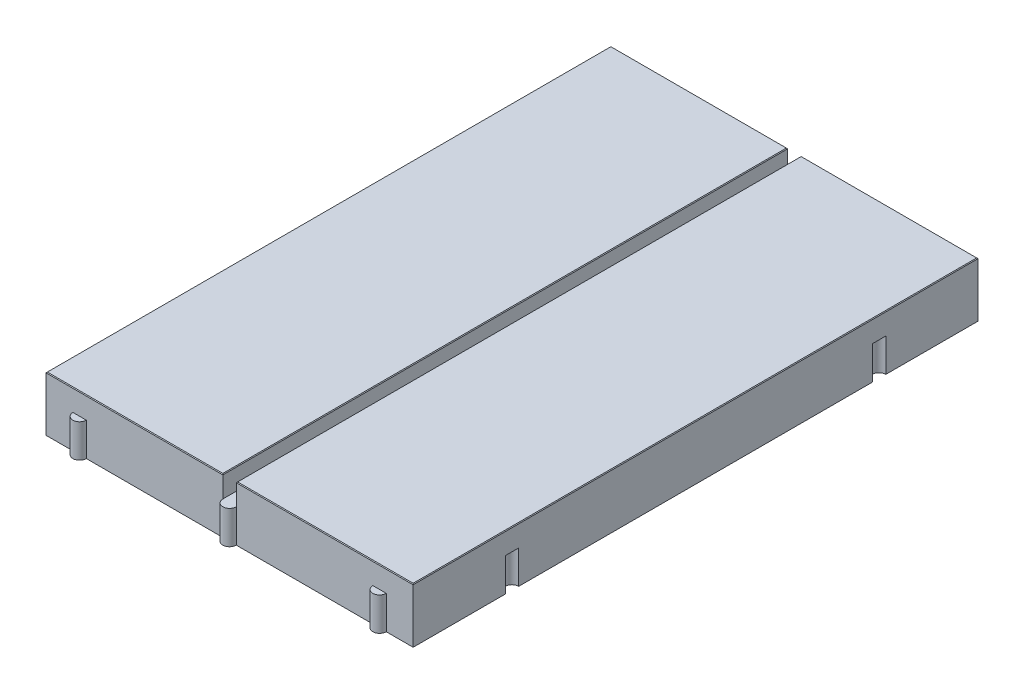
ISO-10303-21;
HEADER;
FILE_DESCRIPTION(('STEP AP214'),'2;1');
FILE_NAME('part.step','',(''),(''),'','','');
FILE_SCHEMA(('AUTOMOTIVE_DESIGN { 1 0 10303 214 1 1 1 1 }'));
ENDSEC;
DATA;
#1=APPLICATION_CONTEXT('core data for automotive mechanical design processes');
#2=APPLICATION_PROTOCOL_DEFINITION('international standard','automotive_design',2000,#1);
#3=PRODUCT_CONTEXT('',#1,'mechanical');
#4=PRODUCT('Part','Part','',(#3));
#5=PRODUCT_RELATED_PRODUCT_CATEGORY('part','',(#4));
#6=PRODUCT_DEFINITION_FORMATION('','',#4);
#7=PRODUCT_DEFINITION_CONTEXT('part definition',#1,'design');
#8=PRODUCT_DEFINITION('design','',#6,#7);
#9=PRODUCT_DEFINITION_SHAPE('','',#8);
#10=(LENGTH_UNIT() NAMED_UNIT(*) SI_UNIT(.MILLI.,.METRE.));
#11=(NAMED_UNIT(*) PLANE_ANGLE_UNIT() SI_UNIT($,.RADIAN.));
#12=(NAMED_UNIT(*) SI_UNIT($,.STERADIAN.) SOLID_ANGLE_UNIT());
#13=UNCERTAINTY_MEASURE_WITH_UNIT(LENGTH_MEASURE(1.E-05),#10,'distance_accuracy_value','');
#14=(GEOMETRIC_REPRESENTATION_CONTEXT(3) GLOBAL_UNCERTAINTY_ASSIGNED_CONTEXT((#13)) GLOBAL_UNIT_ASSIGNED_CONTEXT((#10,
#11,#12)) REPRESENTATION_CONTEXT('',''));
#15=CARTESIAN_POINT('',(0.,0.,0.));
#16=DIRECTION('',(0.,0.,1.));
#17=DIRECTION('',(1.,0.,0.));
#18=AXIS2_PLACEMENT_3D('',#15,#16,#17);
#19=CARTESIAN_POINT('',(27.3,0.,42.));
#20=DIRECTION('',(0.,1.,0.));
#21=DIRECTION('',(0.,0.,1.));
#22=AXIS2_PLACEMENT_3D('',#19,#20,#21);
#23=PLANE('',#22);
#24=CARTESIAN_POINT('',(22.3,0.,-42.));
#25=DIRECTION('',(0.,1.,0.));
#26=DIRECTION('',(0.,0.,1.));
#27=AXIS2_PLACEMENT_3D('',#24,#25,#26);
#28=CIRCLE('',#27,1.);
#29=CARTESIAN_POINT('',(21.3,0.,-42.));
#30=VERTEX_POINT('',#29);
#31=CARTESIAN_POINT('',(23.3,0.,-42.));
#32=VERTEX_POINT('',#31);
#33=EDGE_CURVE('E233',#30,#32,#28,.T.);
#34=ORIENTED_EDGE('',*,*,#33,.T.);
#35=DIRECTION('',(-1.,0.,0.));
#36=VECTOR('',#35,1.);
#37=CARTESIAN_POINT('',(-27.3,0.,-42.));
#38=LINE('',#37,#36);
#39=CARTESIAN_POINT('',(27.3,0.,-42.));
#40=VERTEX_POINT('',#39);
#41=EDGE_CURVE('E245',#40,#32,#38,.T.);
#42=ORIENTED_EDGE('',*,*,#41,.F.);
#43=DIRECTION('',(0.,0.,-1.));
#44=VECTOR('',#43,1.);
#45=CARTESIAN_POINT('',(27.3,0.,-42.));
#46=LINE('',#45,#44);
#47=CARTESIAN_POINT('',(27.3,0.,-28.3));
#48=VERTEX_POINT('',#47);
#49=EDGE_CURVE('E269',#48,#40,#46,.T.);
#50=ORIENTED_EDGE('',*,*,#49,.F.);
#51=CARTESIAN_POINT('',(27.3,0.,-27.3));
#52=DIRECTION('',(0.,1.,0.));
#53=DIRECTION('',(0.,0.,1.));
#54=AXIS2_PLACEMENT_3D('',#51,#52,#53);
#55=CIRCLE('',#54,1.);
#56=CARTESIAN_POINT('',(27.3,0.,-26.3));
#57=VERTEX_POINT('',#56);
#58=EDGE_CURVE('E389',#48,#57,#55,.T.);
#59=ORIENTED_EDGE('',*,*,#58,.T.);
#60=CARTESIAN_POINT('',(27.3,0.,26.3));
#61=VERTEX_POINT('',#60);
#62=EDGE_CURVE('E268',#61,#57,#46,.T.);
#63=ORIENTED_EDGE('',*,*,#62,.F.);
#64=CARTESIAN_POINT('',(27.3,0.,27.3));
#65=DIRECTION('',(0.,1.,0.));
#66=DIRECTION('',(0.,0.,1.));
#67=AXIS2_PLACEMENT_3D('',#64,#65,#66);
#68=CIRCLE('',#67,0.999999999999997);
#69=CARTESIAN_POINT('',(27.3,0.,28.3));
#70=VERTEX_POINT('',#69);
#71=EDGE_CURVE('E402',#61,#70,#68,.T.);
#72=ORIENTED_EDGE('',*,*,#71,.T.);
#73=CARTESIAN_POINT('',(27.3,0.,42.));
#74=VERTEX_POINT('',#73);
#75=EDGE_CURVE('E262',#74,#70,#46,.T.);
#76=ORIENTED_EDGE('',*,*,#75,.F.);
#77=DIRECTION('',(1.,0.,0.));
#78=VECTOR('',#77,1.);
#79=CARTESIAN_POINT('',(-27.3,0.,42.));
#80=LINE('',#79,#78);
#81=CARTESIAN_POINT('',(23.3,0.,42.));
#82=VERTEX_POINT('',#81);
#83=EDGE_CURVE('E445',#82,#74,#80,.T.);
#84=ORIENTED_EDGE('',*,*,#83,.F.);
#85=CARTESIAN_POINT('',(22.3,0.,42.));
#86=DIRECTION('',(0.,1.,0.));
#87=DIRECTION('',(0.,0.,1.));
#88=AXIS2_PLACEMENT_3D('',#85,#86,#87);
#89=CIRCLE('',#88,0.999999999999999);
#90=CARTESIAN_POINT('',(21.3,0.,42.));
#91=VERTEX_POINT('',#90);
#92=EDGE_CURVE('E319',#91,#82,#89,.T.);
#93=ORIENTED_EDGE('',*,*,#92,.F.);
#94=CARTESIAN_POINT('',(1.,0.,42.));
#95=VERTEX_POINT('',#94);
#96=EDGE_CURVE('E446',#95,#91,#80,.T.);
#97=ORIENTED_EDGE('',*,*,#96,.F.);
#98=CARTESIAN_POINT('',(0.,0.,42.));
#99=DIRECTION('',(0.,1.,0.));
#100=DIRECTION('',(0.,0.,1.));
#101=AXIS2_PLACEMENT_3D('',#98,#99,#100);
#102=CIRCLE('',#101,1.);
#103=CARTESIAN_POINT('',(-1.,0.,42.));
#104=VERTEX_POINT('',#103);
#105=EDGE_CURVE('E322',#104,#95,#102,.T.);
#106=ORIENTED_EDGE('',*,*,#105,.F.);
#107=CARTESIAN_POINT('',(-21.3,0.,42.));
#108=VERTEX_POINT('',#107);
#109=EDGE_CURVE('E451',#108,#104,#80,.T.);
#110=ORIENTED_EDGE('',*,*,#109,.F.);
#111=CARTESIAN_POINT('',(-22.3,0.,42.));
#112=DIRECTION('',(0.,1.,0.));
#113=DIRECTION('',(0.,0.,1.));
#114=AXIS2_PLACEMENT_3D('',#111,#112,#113);
#115=CIRCLE('',#114,1.);
#116=CARTESIAN_POINT('',(-23.3,0.,42.));
#117=VERTEX_POINT('',#116);
#118=EDGE_CURVE('E365',#117,#108,#115,.T.);
#119=ORIENTED_EDGE('',*,*,#118,.F.);
#120=CARTESIAN_POINT('',(-27.3,0.,42.));
#121=VERTEX_POINT('',#120);
#122=EDGE_CURVE('E448',#121,#117,#80,.T.);
#123=ORIENTED_EDGE('',*,*,#122,.F.);
#124=DIRECTION('',(0.,0.,1.));
#125=VECTOR('',#124,1.);
#126=CARTESIAN_POINT('',(-27.3,0.,-42.));
#127=LINE('',#126,#125);
#128=CARTESIAN_POINT('',(-27.3,0.,28.3));
#129=VERTEX_POINT('',#128);
#130=EDGE_CURVE('E254',#129,#121,#127,.T.);
#131=ORIENTED_EDGE('',*,*,#130,.F.);
#132=CARTESIAN_POINT('',(-27.3,0.,27.3));
#133=DIRECTION('',(0.,1.,0.));
#134=DIRECTION('',(0.,0.,1.));
#135=AXIS2_PLACEMENT_3D('',#132,#133,#134);
#136=CIRCLE('',#135,1.);
#137=CARTESIAN_POINT('',(-27.3,0.,26.3));
#138=VERTEX_POINT('',#137);
#139=EDGE_CURVE('E340',#138,#129,#136,.T.);
#140=ORIENTED_EDGE('',*,*,#139,.F.);
#141=CARTESIAN_POINT('',(-27.3,0.,-26.3));
#142=VERTEX_POINT('',#141);
#143=EDGE_CURVE('E257',#142,#138,#127,.T.);
#144=ORIENTED_EDGE('',*,*,#143,.F.);
#145=CARTESIAN_POINT('',(-27.3,0.,-27.3));
#146=DIRECTION('',(0.,1.,0.));
#147=DIRECTION('',(0.,0.,1.));
#148=AXIS2_PLACEMENT_3D('',#145,#146,#147);
#149=CIRCLE('',#148,1.);
#150=CARTESIAN_POINT('',(-27.3,0.,-28.3));
#151=VERTEX_POINT('',#150);
#152=EDGE_CURVE('E335',#151,#142,#149,.T.);
#153=ORIENTED_EDGE('',*,*,#152,.F.);
#154=CARTESIAN_POINT('',(-27.3,0.,-42.));
#155=VERTEX_POINT('',#154);
#156=EDGE_CURVE('E259',#155,#151,#127,.T.);
#157=ORIENTED_EDGE('',*,*,#156,.F.);
#158=CARTESIAN_POINT('',(-23.3,0.,-42.));
#159=VERTEX_POINT('',#158);
#160=EDGE_CURVE('E256',#159,#155,#38,.T.);
#161=ORIENTED_EDGE('',*,*,#160,.F.);
#162=CARTESIAN_POINT('',(-22.3,0.,-42.));
#163=DIRECTION('',(0.,1.,0.));
#164=DIRECTION('',(0.,0.,1.));
#165=AXIS2_PLACEMENT_3D('',#162,#163,#164);
#166=CIRCLE('',#165,1.);
#167=CARTESIAN_POINT('',(-21.3,0.,-42.));
#168=VERTEX_POINT('',#167);
#169=EDGE_CURVE('E414',#159,#168,#166,.T.);
#170=ORIENTED_EDGE('',*,*,#169,.T.);
#171=CARTESIAN_POINT('',(-1.,0.,-42.));
#172=VERTEX_POINT('',#171);
#173=EDGE_CURVE('E260',#172,#168,#38,.T.);
#174=ORIENTED_EDGE('',*,*,#173,.F.);
#175=CARTESIAN_POINT('',(0.,0.,-42.));
#176=DIRECTION('',(0.,1.,0.));
#177=DIRECTION('',(0.,0.,1.));
#178=AXIS2_PLACEMENT_3D('',#175,#176,#177);
#179=CIRCLE('',#178,1.);
#180=CARTESIAN_POINT('',(1.,0.,-42.));
#181=VERTEX_POINT('',#180);
#182=EDGE_CURVE('E425',#172,#181,#179,.T.);
#183=ORIENTED_EDGE('',*,*,#182,.T.);
#184=EDGE_CURVE('E247',#30,#181,#38,.T.);
#185=ORIENTED_EDGE('',*,*,#184,.F.);
#186=EDGE_LOOP('',(#34,#42,#50,#59,#63,#72,#76,#84,#93,#97,#106,#110,#119,#123,#131,#140,#144,
#153,#157,#161,#170,#174,#183,#185));
#187=FACE_BOUND('',#186,.T.);
#188=ADVANCED_FACE('F34',(#187),#23,.F.);
#189=CARTESIAN_POINT('',(-27.3,8.15,-42.));
#190=DIRECTION('',(0.,0.,1.));
#191=DIRECTION('',(1.,0.,0.));
#192=AXIS2_PLACEMENT_3D('',#189,#190,#191);
#193=PLANE('',#192);
#194=DIRECTION('',(0.,-1.,0.));
#195=VECTOR('',#194,1.);
#196=CARTESIAN_POINT('',(21.3,7.18606797749979,-42.));
#197=LINE('',#196,#195);
#198=CARTESIAN_POINT('',(21.3,4.95,-42.));
#199=VERTEX_POINT('',#198);
#200=EDGE_CURVE('E51',#199,#30,#197,.T.);
#201=ORIENTED_EDGE('',*,*,#200,.T.);
#202=ORIENTED_EDGE('',*,*,#184,.T.);
#203=DIRECTION('',(0.,-1.,0.));
#204=VECTOR('',#203,1.);
#205=CARTESIAN_POINT('',(1.,7.18606797749979,-42.));
#206=LINE('',#205,#204);
#207=CARTESIAN_POINT('',(1.,4.95,-42.));
#208=VERTEX_POINT('',#207);
#209=EDGE_CURVE('E419',#208,#181,#206,.T.);
#210=ORIENTED_EDGE('',*,*,#209,.F.);
#211=DIRECTION('',(0.,1.,0.));
#212=VECTOR('',#211,1.);
#213=CARTESIAN_POINT('',(1.,4.95,-42.));
#214=LINE('',#213,#212);
#215=CARTESIAN_POINT('',(1.,8.04999999999998,-42.));
#216=VERTEX_POINT('',#215);
#217=EDGE_CURVE('E292',#208,#216,#214,.T.);
#218=ORIENTED_EDGE('',*,*,#217,.T.);
#219=DIRECTION('',(1.,0.,0.));
#220=VECTOR('',#219,1.);
#221=CARTESIAN_POINT('',(27.3,8.04999999999998,-42.));
#222=LINE('',#221,#220);
#223=CARTESIAN_POINT('',(27.3,8.04999999999998,-42.));
#224=VERTEX_POINT('',#223);
#225=EDGE_CURVE('E470',#216,#224,#222,.T.);
#226=ORIENTED_EDGE('',*,*,#225,.T.);
#227=DIRECTION('',(0.,-1.,0.));
#228=VECTOR('',#227,1.);
#229=CARTESIAN_POINT('',(27.3,8.15,-42.));
#230=LINE('',#229,#228);
#231=EDGE_CURVE('E253',#224,#40,#230,.T.);
#232=ORIENTED_EDGE('',*,*,#231,.T.);
#233=ORIENTED_EDGE('',*,*,#41,.T.);
#234=DIRECTION('',(0.,-1.,0.));
#235=VECTOR('',#234,1.);
#236=CARTESIAN_POINT('',(23.3,7.18606797749979,-42.));
#237=LINE('',#236,#235);
#238=CARTESIAN_POINT('',(23.3,4.95,-42.));
#239=VERTEX_POINT('',#238);
#240=EDGE_CURVE('E230',#239,#32,#237,.T.);
#241=ORIENTED_EDGE('',*,*,#240,.F.);
#242=DIRECTION('',(1.,0.,0.));
#243=VECTOR('',#242,1.);
#244=CARTESIAN_POINT('',(21.3,4.95,-42.));
#245=LINE('',#244,#243);
#246=EDGE_CURVE('E239',#199,#239,#245,.T.);
#247=ORIENTED_EDGE('',*,*,#246,.F.);
#248=EDGE_LOOP('',(#201,#202,#210,#218,#226,#232,#233,#241,#247));
#249=FACE_BOUND('',#248,.T.);
#250=ADVANCED_FACE('F250',(#249),#193,.F.);
#251=DIRECTION('',(0.,-1.,0.));
#252=VECTOR('',#251,1.);
#253=CARTESIAN_POINT('',(-1.,7.18606797749979,-42.));
#254=LINE('',#253,#252);
#255=CARTESIAN_POINT('',(-1.,4.95,-42.));
#256=VERTEX_POINT('',#255);
#257=EDGE_CURVE('E422',#256,#172,#254,.T.);
#258=ORIENTED_EDGE('',*,*,#257,.T.);
#259=ORIENTED_EDGE('',*,*,#173,.T.);
#260=DIRECTION('',(0.,-1.,0.));
#261=VECTOR('',#260,1.);
#262=CARTESIAN_POINT('',(-21.3,7.18606797749979,-42.));
#263=LINE('',#262,#261);
#264=CARTESIAN_POINT('',(-21.3,4.95,-42.));
#265=VERTEX_POINT('',#264);
#266=EDGE_CURVE('E410',#265,#168,#263,.T.);
#267=ORIENTED_EDGE('',*,*,#266,.F.);
#268=DIRECTION('',(1.,0.,0.));
#269=VECTOR('',#268,1.);
#270=CARTESIAN_POINT('',(-23.3,4.95,-42.));
#271=LINE('',#270,#269);
#272=CARTESIAN_POINT('',(-23.3,4.95,-42.));
#273=VERTEX_POINT('',#272);
#274=EDGE_CURVE('E407',#273,#265,#271,.T.);
#275=ORIENTED_EDGE('',*,*,#274,.F.);
#276=DIRECTION('',(0.,-1.,0.));
#277=VECTOR('',#276,1.);
#278=CARTESIAN_POINT('',(-23.3,7.18606797749979,-42.));
#279=LINE('',#278,#277);
#280=EDGE_CURVE('E59',#273,#159,#279,.T.);
#281=ORIENTED_EDGE('',*,*,#280,.T.);
#282=ORIENTED_EDGE('',*,*,#160,.T.);
#283=DIRECTION('',(0.,-1.,0.));
#284=VECTOR('',#283,1.);
#285=CARTESIAN_POINT('',(-27.3,8.15,-42.));
#286=LINE('',#285,#284);
#287=CARTESIAN_POINT('',(-27.3,8.04999999999998,-42.));
#288=VERTEX_POINT('',#287);
#289=EDGE_CURVE('E456',#288,#155,#286,.T.);
#290=ORIENTED_EDGE('',*,*,#289,.F.);
#291=DIRECTION('',(1.,0.,0.));
#292=VECTOR('',#291,1.);
#293=CARTESIAN_POINT('',(-1.,8.04999999999998,-42.));
#294=LINE('',#293,#292);
#295=CARTESIAN_POINT('',(-1.,8.04999999999998,-42.));
#296=VERTEX_POINT('',#295);
#297=EDGE_CURVE('E468',#288,#296,#294,.T.);
#298=ORIENTED_EDGE('',*,*,#297,.T.);
#299=DIRECTION('',(0.,1.,0.));
#300=VECTOR('',#299,1.);
#301=CARTESIAN_POINT('',(-1.,4.95,-42.));
#302=LINE('',#301,#300);
#303=EDGE_CURVE('E285',#256,#296,#302,.T.);
#304=ORIENTED_EDGE('',*,*,#303,.F.);
#305=EDGE_LOOP('',(#258,#259,#267,#275,#281,#282,#290,#298,#304));
#306=FACE_BOUND('',#305,.T.);
#307=ADVANCED_FACE('F436',(#306),#193,.F.);
#308=CARTESIAN_POINT('',(1.,4.95,-42.));
#309=DIRECTION('',(0.,-1.,0.));
#310=DIRECTION('',(0.,0.,-1.));
#311=AXIS2_PLACEMENT_3D('',#308,#309,#310);
#312=PLANE('',#311);
#313=CARTESIAN_POINT('',(0.,4.95,-42.));
#314=DIRECTION('',(0.,-1.,0.));
#315=DIRECTION('',(0.,0.,-1.));
#316=AXIS2_PLACEMENT_3D('',#313,#314,#315);
#317=CIRCLE('',#316,1.);
#318=EDGE_CURVE('E417',#208,#256,#317,.T.);
#319=ORIENTED_EDGE('',*,*,#318,.T.);
#320=DIRECTION('',(0.,0.,1.));
#321=VECTOR('',#320,1.);
#322=CARTESIAN_POINT('',(-1.,4.95,42.));
#323=LINE('',#322,#321);
#324=CARTESIAN_POINT('',(-1.,4.95,42.));
#325=VERTEX_POINT('',#324);
#326=EDGE_CURVE('E288',#256,#325,#323,.T.);
#327=ORIENTED_EDGE('',*,*,#326,.T.);
#328=CARTESIAN_POINT('',(0.,4.95,42.));
#329=DIRECTION('',(0.,-1.,0.));
#330=DIRECTION('',(0.,0.,-1.));
#331=AXIS2_PLACEMENT_3D('',#328,#329,#330);
#332=CIRCLE('',#331,1.);
#333=CARTESIAN_POINT('',(1.,4.95,42.));
#334=VERTEX_POINT('',#333);
#335=EDGE_CURVE('E333',#334,#325,#332,.T.);
#336=ORIENTED_EDGE('',*,*,#335,.F.);
#337=DIRECTION('',(0.,0.,-1.));
#338=VECTOR('',#337,1.);
#339=CARTESIAN_POINT('',(1.,4.95,42.));
#340=LINE('',#339,#338);
#341=EDGE_CURVE('E298',#334,#208,#340,.T.);
#342=ORIENTED_EDGE('',*,*,#341,.T.);
#343=EDGE_LOOP('',(#319,#327,#336,#342));
#344=FACE_BOUND('',#343,.T.);
#345=ADVANCED_FACE('F555',(#344),#312,.F.);
#346=CARTESIAN_POINT('',(27.3,8.15,-42.));
#347=DIRECTION('',(-1.,0.,0.));
#348=DIRECTION('',(0.,0.,1.));
#349=AXIS2_PLACEMENT_3D('',#346,#347,#348);
#350=PLANE('',#349);
#351=DIRECTION('',(0.,-1.,0.));
#352=VECTOR('',#351,1.);
#353=CARTESIAN_POINT('',(27.3,7.18606797749979,26.3));
#354=LINE('',#353,#352);
#355=CARTESIAN_POINT('',(27.3,4.95,26.3));
#356=VERTEX_POINT('',#355);
#357=EDGE_CURVE('E399',#356,#61,#354,.T.);
#358=ORIENTED_EDGE('',*,*,#357,.T.);
#359=ORIENTED_EDGE('',*,*,#62,.T.);
#360=DIRECTION('',(0.,-1.,0.));
#361=VECTOR('',#360,1.);
#362=CARTESIAN_POINT('',(27.3,7.18606797749979,-26.3));
#363=LINE('',#362,#361);
#364=CARTESIAN_POINT('',(27.3,4.95,-26.3));
#365=VERTEX_POINT('',#364);
#366=EDGE_CURVE('E384',#365,#57,#363,.T.);
#367=ORIENTED_EDGE('',*,*,#366,.F.);
#368=DIRECTION('',(0.,0.,1.));
#369=VECTOR('',#368,1.);
#370=CARTESIAN_POINT('',(27.3,4.95,-28.3));
#371=LINE('',#370,#369);
#372=CARTESIAN_POINT('',(27.3,4.95,-28.3));
#373=VERTEX_POINT('',#372);
#374=EDGE_CURVE('E381',#373,#365,#371,.T.);
#375=ORIENTED_EDGE('',*,*,#374,.F.);
#376=DIRECTION('',(0.,-1.,0.));
#377=VECTOR('',#376,1.);
#378=CARTESIAN_POINT('',(27.3,7.18606797749979,-28.3));
#379=LINE('',#378,#377);
#380=EDGE_CURVE('E387',#373,#48,#379,.T.);
#381=ORIENTED_EDGE('',*,*,#380,.T.);
#382=ORIENTED_EDGE('',*,*,#49,.T.);
#383=ORIENTED_EDGE('',*,*,#231,.F.);
#384=DIRECTION('',(0.,0.,1.));
#385=VECTOR('',#384,1.);
#386=CARTESIAN_POINT('',(27.3,8.04999999999998,42.));
#387=LINE('',#386,#385);
#388=CARTESIAN_POINT('',(27.3,8.04999999999998,42.));
#389=VERTEX_POINT('',#388);
#390=EDGE_CURVE('E472',#224,#389,#387,.T.);
#391=ORIENTED_EDGE('',*,*,#390,.T.);
#392=DIRECTION('',(0.,-1.,0.));
#393=VECTOR('',#392,1.);
#394=CARTESIAN_POINT('',(27.3,8.15,42.));
#395=LINE('',#394,#393);
#396=EDGE_CURVE('E450',#389,#74,#395,.T.);
#397=ORIENTED_EDGE('',*,*,#396,.T.);
#398=ORIENTED_EDGE('',*,*,#75,.T.);
#399=DIRECTION('',(0.,-1.,0.));
#400=VECTOR('',#399,1.);
#401=CARTESIAN_POINT('',(27.3,7.18606797749979,28.3));
#402=LINE('',#401,#400);
#403=CARTESIAN_POINT('',(27.3,4.95,28.3));
#404=VERTEX_POINT('',#403);
#405=EDGE_CURVE('E397',#404,#70,#402,.T.);
#406=ORIENTED_EDGE('',*,*,#405,.F.);
#407=DIRECTION('',(0.,0.,1.));
#408=VECTOR('',#407,1.);
#409=CARTESIAN_POINT('',(27.3,4.95,26.3));
#410=LINE('',#409,#408);
#411=EDGE_CURVE('E394',#356,#404,#410,.T.);
#412=ORIENTED_EDGE('',*,*,#411,.F.);
#413=EDGE_LOOP('',(#358,#359,#367,#375,#381,#382,#383,#391,#397,#398,#406,#412));
#414=FACE_BOUND('',#413,.T.);
#415=ADVANCED_FACE('F556',(#414),#350,.F.);
#416=CARTESIAN_POINT('',(-27.3,8.15,42.));
#417=DIRECTION('',(0.,0.,-1.));
#418=DIRECTION('',(-1.,0.,0.));
#419=AXIS2_PLACEMENT_3D('',#416,#417,#418);
#420=PLANE('',#419);
#421=DIRECTION('',(0.,-1.,0.));
#422=VECTOR('',#421,1.);
#423=CARTESIAN_POINT('',(-21.3,7.1860679774998,42.));
#424=LINE('',#423,#422);
#425=CARTESIAN_POINT('',(-21.3,4.95,42.));
#426=VERTEX_POINT('',#425);
#427=EDGE_CURVE('E369',#426,#108,#424,.T.);
#428=ORIENTED_EDGE('',*,*,#427,.T.);
#429=ORIENTED_EDGE('',*,*,#109,.T.);
#430=DIRECTION('',(0.,-1.,0.));
#431=VECTOR('',#430,1.);
#432=CARTESIAN_POINT('',(-1.,7.1860679774998,42.));
#433=LINE('',#432,#431);
#434=EDGE_CURVE('E330',#325,#104,#433,.T.);
#435=ORIENTED_EDGE('',*,*,#434,.F.);
#436=DIRECTION('',(0.,1.,0.));
#437=VECTOR('',#436,1.);
#438=CARTESIAN_POINT('',(-1.,4.95,42.));
#439=LINE('',#438,#437);
#440=CARTESIAN_POINT('',(-1.,8.04999999999998,42.));
#441=VERTEX_POINT('',#440);
#442=EDGE_CURVE('E278',#325,#441,#439,.T.);
#443=ORIENTED_EDGE('',*,*,#442,.T.);
#444=DIRECTION('',(-1.,0.,0.));
#445=VECTOR('',#444,1.);
#446=CARTESIAN_POINT('',(-27.3,8.04999999999998,42.));
#447=LINE('',#446,#445);
#448=CARTESIAN_POINT('',(-27.3,8.04999999999998,42.));
#449=VERTEX_POINT('',#448);
#450=EDGE_CURVE('E474',#441,#449,#447,.T.);
#451=ORIENTED_EDGE('',*,*,#450,.T.);
#452=DIRECTION('',(0.,-1.,0.));
#453=VECTOR('',#452,1.);
#454=CARTESIAN_POINT('',(-27.3,8.15,42.));
#455=LINE('',#454,#453);
#456=EDGE_CURVE('E453',#449,#121,#455,.T.);
#457=ORIENTED_EDGE('',*,*,#456,.T.);
#458=ORIENTED_EDGE('',*,*,#122,.T.);
#459=DIRECTION('',(0.,-1.,0.));
#460=VECTOR('',#459,1.);
#461=CARTESIAN_POINT('',(-23.3,7.1860679774998,42.));
#462=LINE('',#461,#460);
#463=CARTESIAN_POINT('',(-23.3,4.95,42.));
#464=VERTEX_POINT('',#463);
#465=EDGE_CURVE('E373',#464,#117,#462,.T.);
#466=ORIENTED_EDGE('',*,*,#465,.F.);
#467=DIRECTION('',(-1.,0.,0.));
#468=VECTOR('',#467,1.);
#469=CARTESIAN_POINT('',(-23.3,4.95,42.));
#470=LINE('',#469,#468);
#471=EDGE_CURVE('E370',#426,#464,#470,.T.);
#472=ORIENTED_EDGE('',*,*,#471,.F.);
#473=EDGE_LOOP('',(#428,#429,#435,#443,#451,#457,#458,#466,#472));
#474=FACE_BOUND('',#473,.T.);
#475=ADVANCED_FACE('F521',(#474),#420,.F.);
#476=CARTESIAN_POINT('',(-27.3,8.15,-42.));
#477=DIRECTION('',(1.,0.,0.));
#478=DIRECTION('',(0.,0.,-1.));
#479=AXIS2_PLACEMENT_3D('',#476,#477,#478);
#480=PLANE('',#479);
#481=DIRECTION('',(0.,-1.,0.));
#482=VECTOR('',#481,1.);
#483=CARTESIAN_POINT('',(-27.3,7.1860679774998,28.3));
#484=LINE('',#483,#482);
#485=CARTESIAN_POINT('',(-27.3,4.95,28.3));
#486=VERTEX_POINT('',#485);
#487=EDGE_CURVE('E354',#486,#129,#484,.T.);
#488=ORIENTED_EDGE('',*,*,#487,.T.);
#489=ORIENTED_EDGE('',*,*,#130,.T.);
#490=ORIENTED_EDGE('',*,*,#456,.F.);
#491=DIRECTION('',(0.,0.,-1.));
#492=VECTOR('',#491,1.);
#493=CARTESIAN_POINT('',(-27.3,8.04999999999998,-42.));
#494=LINE('',#493,#492);
#495=EDGE_CURVE('E43',#449,#288,#494,.T.);
#496=ORIENTED_EDGE('',*,*,#495,.T.);
#497=ORIENTED_EDGE('',*,*,#289,.T.);
#498=ORIENTED_EDGE('',*,*,#156,.T.);
#499=DIRECTION('',(0.,-1.,0.));
#500=VECTOR('',#499,1.);
#501=CARTESIAN_POINT('',(-27.3,7.1860679774998,-28.3));
#502=LINE('',#501,#500);
#503=CARTESIAN_POINT('',(-27.3,4.95,-28.3));
#504=VERTEX_POINT('',#503);
#505=EDGE_CURVE('E344',#504,#151,#502,.T.);
#506=ORIENTED_EDGE('',*,*,#505,.F.);
#507=DIRECTION('',(0.,0.,-1.));
#508=VECTOR('',#507,1.);
#509=CARTESIAN_POINT('',(-27.3,4.95,-28.3));
#510=LINE('',#509,#508);
#511=CARTESIAN_POINT('',(-27.3,4.95,-26.3));
#512=VERTEX_POINT('',#511);
#513=EDGE_CURVE('E336',#512,#504,#510,.T.);
#514=ORIENTED_EDGE('',*,*,#513,.F.);
#515=DIRECTION('',(0.,-1.,0.));
#516=VECTOR('',#515,1.);
#517=CARTESIAN_POINT('',(-27.3,7.1860679774998,-26.3));
#518=LINE('',#517,#516);
#519=EDGE_CURVE('E343',#512,#142,#518,.T.);
#520=ORIENTED_EDGE('',*,*,#519,.T.);
#521=ORIENTED_EDGE('',*,*,#143,.T.);
#522=DIRECTION('',(0.,-1.,0.));
#523=VECTOR('',#522,1.);
#524=CARTESIAN_POINT('',(-27.3,7.1860679774998,26.3));
#525=LINE('',#524,#523);
#526=CARTESIAN_POINT('',(-27.3,4.95,26.3));
#527=VERTEX_POINT('',#526);
#528=EDGE_CURVE('E358',#527,#138,#525,.T.);
#529=ORIENTED_EDGE('',*,*,#528,.F.);
#530=DIRECTION('',(0.,0.,-1.));
#531=VECTOR('',#530,1.);
#532=CARTESIAN_POINT('',(-27.3,4.95,26.3));
#533=LINE('',#532,#531);
#534=EDGE_CURVE('E355',#486,#527,#533,.T.);
#535=ORIENTED_EDGE('',*,*,#534,.F.);
#536=EDGE_LOOP('',(#488,#489,#490,#496,#497,#498,#506,#514,#520,#521,#529,#535));
#537=FACE_BOUND('',#536,.T.);
#538=ADVANCED_FACE('F550',(#537),#480,.F.);
#539=DIRECTION('',(0.,-1.,0.));
#540=VECTOR('',#539,1.);
#541=CARTESIAN_POINT('',(1.,7.1860679774998,42.));
#542=LINE('',#541,#540);
#543=EDGE_CURVE('E327',#334,#95,#542,.T.);
#544=ORIENTED_EDGE('',*,*,#543,.T.);
#545=ORIENTED_EDGE('',*,*,#96,.T.);
#546=DIRECTION('',(0.,-1.,0.));
#547=VECTOR('',#546,1.);
#548=CARTESIAN_POINT('',(21.3,7.1860679774998,42.));
#549=LINE('',#548,#547);
#550=CARTESIAN_POINT('',(21.3,4.95,42.));
#551=VERTEX_POINT('',#550);
#552=EDGE_CURVE('E313',#551,#91,#549,.T.);
#553=ORIENTED_EDGE('',*,*,#552,.F.);
#554=DIRECTION('',(-1.,0.,0.));
#555=VECTOR('',#554,1.);
#556=CARTESIAN_POINT('',(0.,4.95,42.));
#557=LINE('',#556,#555);
#558=CARTESIAN_POINT('',(23.3,4.95,42.));
#559=VERTEX_POINT('',#558);
#560=EDGE_CURVE('E312',#559,#551,#557,.T.);
#561=ORIENTED_EDGE('',*,*,#560,.F.);
#562=DIRECTION('',(0.,-1.,0.));
#563=VECTOR('',#562,1.);
#564=CARTESIAN_POINT('',(23.3,7.1860679774998,42.));
#565=LINE('',#564,#563);
#566=EDGE_CURVE('E316',#559,#82,#565,.T.);
#567=ORIENTED_EDGE('',*,*,#566,.T.);
#568=ORIENTED_EDGE('',*,*,#83,.T.);
#569=ORIENTED_EDGE('',*,*,#396,.F.);
#570=DIRECTION('',(-1.,0.,0.));
#571=VECTOR('',#570,1.);
#572=CARTESIAN_POINT('',(1.,8.04999999999998,42.));
#573=LINE('',#572,#571);
#574=CARTESIAN_POINT('',(1.,8.04999999999998,42.));
#575=VERTEX_POINT('',#574);
#576=EDGE_CURVE('E477',#389,#575,#573,.T.);
#577=ORIENTED_EDGE('',*,*,#576,.T.);
#578=DIRECTION('',(0.,1.,0.));
#579=VECTOR('',#578,1.);
#580=CARTESIAN_POINT('',(1.,4.95,42.));
#581=LINE('',#580,#579);
#582=EDGE_CURVE('E275',#334,#575,#581,.T.);
#583=ORIENTED_EDGE('',*,*,#582,.F.);
#584=EDGE_LOOP('',(#544,#545,#553,#561,#567,#568,#569,#577,#583));
#585=FACE_BOUND('',#584,.T.);
#586=ADVANCED_FACE('F539',(#585),#420,.F.);
#587=CARTESIAN_POINT('',(27.3,8.15,42.));
#588=DIRECTION('',(0.,1.,0.));
#589=DIRECTION('',(0.,0.,1.));
#590=AXIS2_PLACEMENT_3D('',#587,#588,#589);
#591=PLANE('',#590);
#592=DIRECTION('',(0.,0.,-1.));
#593=VECTOR('',#592,1.);
#594=CARTESIAN_POINT('',(27.2,8.15,-42.));
#595=LINE('',#594,#593);
#596=CARTESIAN_POINT('',(27.2,8.15,41.9));
#597=VERTEX_POINT('',#596);
#598=CARTESIAN_POINT('',(27.2,8.15,-41.9));
#599=VERTEX_POINT('',#598);
#600=EDGE_CURVE('E463',#597,#599,#595,.T.);
#601=ORIENTED_EDGE('',*,*,#600,.T.);
#602=DIRECTION('',(-1.,0.,0.));
#603=VECTOR('',#602,1.);
#604=CARTESIAN_POINT('',(1.,8.15,-41.9));
#605=LINE('',#604,#603);
#606=CARTESIAN_POINT('',(1.1,8.15,-41.9));
#607=VERTEX_POINT('',#606);
#608=EDGE_CURVE('E465',#599,#607,#605,.T.);
#609=ORIENTED_EDGE('',*,*,#608,.T.);
#610=DIRECTION('',(0.,0.,1.));
#611=VECTOR('',#610,1.);
#612=CARTESIAN_POINT('',(1.1,8.15,42.));
#613=LINE('',#612,#611);
#614=CARTESIAN_POINT('',(1.1,8.15,41.9));
#615=VERTEX_POINT('',#614);
#616=EDGE_CURVE('E459',#607,#615,#613,.T.);
#617=ORIENTED_EDGE('',*,*,#616,.T.);
#618=DIRECTION('',(1.,0.,0.));
#619=VECTOR('',#618,1.);
#620=CARTESIAN_POINT('',(27.3,8.15,41.9));
#621=LINE('',#620,#619);
#622=EDGE_CURVE('E461',#615,#597,#621,.T.);
#623=ORIENTED_EDGE('',*,*,#622,.T.);
#624=EDGE_LOOP('',(#601,#609,#617,#623));
#625=FACE_BOUND('',#624,.T.);
#626=ADVANCED_FACE('F532',(#625),#591,.T.);
#627=DIRECTION('',(0.,0.,1.));
#628=VECTOR('',#627,1.);
#629=CARTESIAN_POINT('',(-27.2,8.15,42.));
#630=LINE('',#629,#628);
#631=CARTESIAN_POINT('',(-27.2,8.15,-41.9));
#632=VERTEX_POINT('',#631);
#633=CARTESIAN_POINT('',(-27.2,8.15,41.9));
#634=VERTEX_POINT('',#633);
#635=EDGE_CURVE('E485',#632,#634,#630,.T.);
#636=ORIENTED_EDGE('',*,*,#635,.T.);
#637=DIRECTION('',(1.,0.,0.));
#638=VECTOR('',#637,1.);
#639=CARTESIAN_POINT('',(-1.,8.15,41.9));
#640=LINE('',#639,#638);
#641=CARTESIAN_POINT('',(-1.1,8.15,41.9));
#642=VERTEX_POINT('',#641);
#643=EDGE_CURVE('E487',#634,#642,#640,.T.);
#644=ORIENTED_EDGE('',*,*,#643,.T.);
#645=DIRECTION('',(0.,0.,-1.));
#646=VECTOR('',#645,1.);
#647=CARTESIAN_POINT('',(-1.1,8.15,-42.));
#648=LINE('',#647,#646);
#649=CARTESIAN_POINT('',(-1.1,8.15,-41.9));
#650=VERTEX_POINT('',#649);
#651=EDGE_CURVE('E481',#642,#650,#648,.T.);
#652=ORIENTED_EDGE('',*,*,#651,.T.);
#653=DIRECTION('',(-1.,0.,0.));
#654=VECTOR('',#653,1.);
#655=CARTESIAN_POINT('',(-27.3,8.15,-41.9));
#656=LINE('',#655,#654);
#657=EDGE_CURVE('E483',#650,#632,#656,.T.);
#658=ORIENTED_EDGE('',*,*,#657,.T.);
#659=EDGE_LOOP('',(#636,#644,#652,#658));
#660=FACE_BOUND('',#659,.T.);
#661=ADVANCED_FACE('F529',(#660),#591,.T.);
#662=CARTESIAN_POINT('',(1.,4.95,42.));
#663=DIRECTION('',(1.,0.,0.));
#664=DIRECTION('',(0.,0.,-1.));
#665=AXIS2_PLACEMENT_3D('',#662,#663,#664);
#666=PLANE('',#665);
#667=ORIENTED_EDGE('',*,*,#582,.T.);
#668=DIRECTION('',(0.,0.,-1.));
#669=VECTOR('',#668,1.);
#670=CARTESIAN_POINT('',(1.,8.04999999999998,-42.));
#671=LINE('',#670,#669);
#672=EDGE_CURVE('E479',#575,#216,#671,.T.);
#673=ORIENTED_EDGE('',*,*,#672,.T.);
#674=ORIENTED_EDGE('',*,*,#217,.F.);
#675=ORIENTED_EDGE('',*,*,#341,.F.);
#676=EDGE_LOOP('',(#667,#673,#674,#675));
#677=FACE_BOUND('',#676,.T.);
#678=ADVANCED_FACE('F531',(#677),#666,.F.);
#679=CARTESIAN_POINT('',(-1.,4.95,42.));
#680=DIRECTION('',(-1.,0.,0.));
#681=DIRECTION('',(0.,0.,1.));
#682=AXIS2_PLACEMENT_3D('',#679,#680,#681);
#683=PLANE('',#682);
#684=ORIENTED_EDGE('',*,*,#303,.T.);
#685=DIRECTION('',(0.,0.,1.));
#686=VECTOR('',#685,1.);
#687=CARTESIAN_POINT('',(-1.,8.04999999999998,42.));
#688=LINE('',#687,#686);
#689=EDGE_CURVE('E11',#296,#441,#688,.T.);
#690=ORIENTED_EDGE('',*,*,#689,.T.);
#691=ORIENTED_EDGE('',*,*,#442,.F.);
#692=ORIENTED_EDGE('',*,*,#326,.F.);
#693=EDGE_LOOP('',(#684,#690,#691,#692));
#694=FACE_BOUND('',#693,.T.);
#695=ADVANCED_FACE('F516',(#694),#683,.F.);
#696=CARTESIAN_POINT('',(27.3,8.15,41.9));
#697=DIRECTION('',(0.,0.707106781186499,0.707106781186597));
#698=DIRECTION('',(0.,-0.707106781186597,0.707106781186499));
#699=AXIS2_PLACEMENT_3D('',#696,#697,#698);
#700=PLANE('',#699);
#701=DIRECTION('',(0.577350269189601,0.577350269189678,-0.577350269189598));
#702=VECTOR('',#701,1.);
#703=CARTESIAN_POINT('',(1.,8.04999999999998,42.));
#704=LINE('',#703,#702);
#705=EDGE_CURVE('E306',#575,#615,#704,.T.);
#706=ORIENTED_EDGE('',*,*,#705,.F.);
#707=ORIENTED_EDGE('',*,*,#576,.F.);
#708=DIRECTION('',(-0.577350269189599,0.577350269189679,-0.577350269189599));
#709=VECTOR('',#708,1.);
#710=CARTESIAN_POINT('',(27.2333333333333,8.11666666666666,41.9333333333333));
#711=LINE('',#710,#709);
#712=EDGE_CURVE('E304',#597,#389,#711,.F.);
#713=ORIENTED_EDGE('',*,*,#712,.F.);
#714=ORIENTED_EDGE('',*,*,#622,.F.);
#715=EDGE_LOOP('',(#706,#707,#713,#714));
#716=FACE_BOUND('',#715,.T.);
#717=ADVANCED_FACE('F570',(#716),#700,.T.);
#718=CARTESIAN_POINT('',(27.2,8.15,42.));
#719=DIRECTION('',(0.707106781186597,0.707106781186499,0.));
#720=DIRECTION('',(-0.707106781186499,0.707106781186597,0.));
#721=AXIS2_PLACEMENT_3D('',#718,#719,#720);
#722=PLANE('',#721);
#723=ORIENTED_EDGE('',*,*,#712,.T.);
#724=ORIENTED_EDGE('',*,*,#390,.F.);
#725=DIRECTION('',(-0.577350269189599,0.577350269189679,0.577350269189599));
#726=VECTOR('',#725,1.);
#727=CARTESIAN_POINT('',(-0.766666666664088,36.116666666668,-13.9333333333359));
#728=LINE('',#727,#726);
#729=EDGE_CURVE('E493',#599,#224,#728,.F.);
#730=ORIENTED_EDGE('',*,*,#729,.F.);
#731=ORIENTED_EDGE('',*,*,#600,.F.);
#732=EDGE_LOOP('',(#723,#724,#730,#731));
#733=FACE_BOUND('',#732,.T.);
#734=ADVANCED_FACE('F566',(#733),#722,.T.);
#735=CARTESIAN_POINT('',(1.,8.04999999999998,42.));
#736=DIRECTION('',(-0.707106781186595,0.7071067811865,0.));
#737=DIRECTION('',(-0.7071067811865,-0.707106781186595,0.));
#738=AXIS2_PLACEMENT_3D('',#735,#736,#737);
#739=PLANE('',#738);
#740=ORIENTED_EDGE('',*,*,#705,.T.);
#741=ORIENTED_EDGE('',*,*,#616,.F.);
#742=DIRECTION('',(-0.577350269189601,-0.577350269189678,-0.577350269189598));
#743=VECTOR('',#742,1.);
#744=CARTESIAN_POINT('',(28.9999999999974,36.0500000000012,-14.0000000000027));
#745=LINE('',#744,#743);
#746=EDGE_CURVE('E491',#216,#607,#745,.F.);
#747=ORIENTED_EDGE('',*,*,#746,.F.);
#748=ORIENTED_EDGE('',*,*,#672,.F.);
#749=EDGE_LOOP('',(#740,#741,#747,#748));
#750=FACE_BOUND('',#749,.T.);
#751=ADVANCED_FACE('F562',(#750),#739,.T.);
#752=CARTESIAN_POINT('',(27.3,8.15,-41.9));
#753=DIRECTION('',(0.,0.707106781186499,-0.707106781186597));
#754=DIRECTION('',(0.,0.707106781186597,0.707106781186499));
#755=AXIS2_PLACEMENT_3D('',#752,#753,#754);
#756=PLANE('',#755);
#757=ORIENTED_EDGE('',*,*,#729,.T.);
#758=ORIENTED_EDGE('',*,*,#225,.F.);
#759=ORIENTED_EDGE('',*,*,#746,.T.);
#760=ORIENTED_EDGE('',*,*,#608,.F.);
#761=EDGE_LOOP('',(#757,#758,#759,#760));
#762=FACE_BOUND('',#761,.T.);
#763=ADVANCED_FACE('F559',(#762),#756,.T.);
#764=CARTESIAN_POINT('',(27.3,8.15,-41.9));
#765=DIRECTION('',(0.,0.707106781186499,-0.707106781186597));
#766=DIRECTION('',(0.,0.707106781186597,0.707106781186499));
#767=AXIS2_PLACEMENT_3D('',#764,#765,#766);
#768=PLANE('',#767);
#769=DIRECTION('',(-0.577350269189604,0.577350269189677,0.577350269189597));
#770=VECTOR('',#769,1.);
#771=CARTESIAN_POINT('',(-28.9999999999975,36.050000000001,-14.0000000000028));
#772=LINE('',#771,#770);
#773=EDGE_CURVE('E499',#296,#650,#772,.T.);
#774=ORIENTED_EDGE('',*,*,#773,.F.);
#775=ORIENTED_EDGE('',*,*,#297,.F.);
#776=DIRECTION('',(0.577350269189626,0.577350269189666,0.577350269189586));
#777=VECTOR('',#776,1.);
#778=CARTESIAN_POINT('',(-9.03333333333333,26.3166666666679,-23.7333333333346));
#779=LINE('',#778,#777);
#780=EDGE_CURVE('E38',#632,#288,#779,.F.);
#781=ORIENTED_EDGE('',*,*,#780,.F.);
#782=ORIENTED_EDGE('',*,*,#657,.F.);
#783=EDGE_LOOP('',(#774,#775,#781,#782));
#784=FACE_BOUND('',#783,.T.);
#785=ADVANCED_FACE('F36',(#784),#768,.T.);
#786=CARTESIAN_POINT('',(-27.2,8.15,42.));
#787=DIRECTION('',(-0.707106781186572,0.707106781186523,0.));
#788=DIRECTION('',(-0.707106781186523,-0.707106781186572,0.));
#789=AXIS2_PLACEMENT_3D('',#786,#787,#788);
#790=PLANE('',#789);
#791=ORIENTED_EDGE('',*,*,#780,.T.);
#792=ORIENTED_EDGE('',*,*,#495,.F.);
#793=DIRECTION('',(0.577350269189626,0.577350269189666,-0.577350269189586));
#794=VECTOR('',#793,1.);
#795=CARTESIAN_POINT('',(-27.2333333333333,8.11666666666666,41.9333333333333));
#796=LINE('',#795,#794);
#797=EDGE_CURVE('E498',#634,#449,#796,.F.);
#798=ORIENTED_EDGE('',*,*,#797,.F.);
#799=ORIENTED_EDGE('',*,*,#635,.F.);
#800=EDGE_LOOP('',(#791,#792,#798,#799));
#801=FACE_BOUND('',#800,.T.);
#802=ADVANCED_FACE('F510',(#801),#790,.T.);
#803=CARTESIAN_POINT('',(-1.,8.04999999999998,42.));
#804=DIRECTION('',(0.707106781186592,0.707106781186503,0.));
#805=DIRECTION('',(-0.707106781186503,0.707106781186592,0.));
#806=AXIS2_PLACEMENT_3D('',#803,#804,#805);
#807=PLANE('',#806);
#808=ORIENTED_EDGE('',*,*,#773,.T.);
#809=ORIENTED_EDGE('',*,*,#651,.F.);
#810=DIRECTION('',(0.577350269189604,-0.577350269189677,0.577350269189597));
#811=VECTOR('',#810,1.);
#812=CARTESIAN_POINT('',(-1.,8.04999999999998,42.));
#813=LINE('',#812,#811);
#814=EDGE_CURVE('E325',#441,#642,#813,.F.);
#815=ORIENTED_EDGE('',*,*,#814,.F.);
#816=ORIENTED_EDGE('',*,*,#689,.F.);
#817=EDGE_LOOP('',(#808,#809,#815,#816));
#818=FACE_BOUND('',#817,.T.);
#819=ADVANCED_FACE('F527',(#818),#807,.T.);
#820=CARTESIAN_POINT('',(27.3,8.15,41.9));
#821=DIRECTION('',(0.,0.707106781186499,0.707106781186597));
#822=DIRECTION('',(0.,-0.707106781186597,0.707106781186499));
#823=AXIS2_PLACEMENT_3D('',#820,#821,#822);
#824=PLANE('',#823);
#825=ORIENTED_EDGE('',*,*,#797,.T.);
#826=ORIENTED_EDGE('',*,*,#450,.F.);
#827=ORIENTED_EDGE('',*,*,#814,.T.);
#828=ORIENTED_EDGE('',*,*,#643,.F.);
#829=EDGE_LOOP('',(#825,#826,#827,#828));
#830=FACE_BOUND('',#829,.T.);
#831=ADVANCED_FACE('F525',(#830),#824,.T.);
#832=CARTESIAN_POINT('',(22.3,7.1860679774998,42.));
#833=DIRECTION('',(0.,-1.,0.));
#834=DIRECTION('',(0.,0.,-1.));
#835=AXIS2_PLACEMENT_3D('',#832,#833,#834);
#836=CYLINDRICAL_SURFACE('',#835,0.999999999999999);
#837=ORIENTED_EDGE('',*,*,#566,.F.);
#838=CARTESIAN_POINT('',(22.3,4.95,42.));
#839=DIRECTION('',(0.,-1.,0.));
#840=DIRECTION('',(0.,0.,-1.));
#841=AXIS2_PLACEMENT_3D('',#838,#839,#840);
#842=CIRCLE('',#841,0.999999999999999);
#843=EDGE_CURVE('E309',#559,#551,#842,.T.);
#844=ORIENTED_EDGE('',*,*,#843,.T.);
#845=ORIENTED_EDGE('',*,*,#552,.T.);
#846=ORIENTED_EDGE('',*,*,#92,.T.);
#847=EDGE_LOOP('',(#837,#844,#845,#846));
#848=FACE_BOUND('',#847,.T.);
#849=ADVANCED_FACE('F577',(#848),#836,.T.);
#850=CARTESIAN_POINT('',(1.,4.95,-42.));
#851=DIRECTION('',(0.,-1.,0.));
#852=DIRECTION('',(0.,0.,-1.));
#853=AXIS2_PLACEMENT_3D('',#850,#851,#852);
#854=PLANE('',#853);
#855=ORIENTED_EDGE('',*,*,#560,.T.);
#856=ORIENTED_EDGE('',*,*,#843,.F.);
#857=EDGE_LOOP('',(#855,#856));
#858=FACE_BOUND('',#857,.T.);
#859=ADVANCED_FACE('F720',(#858),#854,.F.);
#860=CARTESIAN_POINT('',(0.,7.1860679774998,42.));
#861=DIRECTION('',(0.,-1.,0.));
#862=DIRECTION('',(0.,0.,-1.));
#863=AXIS2_PLACEMENT_3D('',#860,#861,#862);
#864=CYLINDRICAL_SURFACE('',#863,1.);
#865=ORIENTED_EDGE('',*,*,#543,.F.);
#866=ORIENTED_EDGE('',*,*,#335,.T.);
#867=ORIENTED_EDGE('',*,*,#434,.T.);
#868=ORIENTED_EDGE('',*,*,#105,.T.);
#869=EDGE_LOOP('',(#865,#866,#867,#868));
#870=FACE_BOUND('',#869,.T.);
#871=ADVANCED_FACE('F710',(#870),#864,.T.);
#872=CARTESIAN_POINT('',(-27.3,7.1860679774998,-27.3));
#873=DIRECTION('',(0.,-1.,0.));
#874=DIRECTION('',(0.,0.,-1.));
#875=AXIS2_PLACEMENT_3D('',#872,#873,#874);
#876=CYLINDRICAL_SURFACE('',#875,1.);
#877=ORIENTED_EDGE('',*,*,#519,.F.);
#878=CARTESIAN_POINT('',(-27.3,4.95,-27.3));
#879=DIRECTION('',(0.,-1.,0.));
#880=DIRECTION('',(0.,0.,-1.));
#881=AXIS2_PLACEMENT_3D('',#878,#879,#880);
#882=CIRCLE('',#881,1.);
#883=EDGE_CURVE('E339',#512,#504,#882,.T.);
#884=ORIENTED_EDGE('',*,*,#883,.T.);
#885=ORIENTED_EDGE('',*,*,#505,.T.);
#886=ORIENTED_EDGE('',*,*,#152,.T.);
#887=EDGE_LOOP('',(#877,#884,#885,#886));
#888=FACE_BOUND('',#887,.T.);
#889=ADVANCED_FACE('F700',(#888),#876,.T.);
#890=CARTESIAN_POINT('',(1.,4.95,-42.));
#891=DIRECTION('',(0.,-1.,0.));
#892=DIRECTION('',(0.,0.,-1.));
#893=AXIS2_PLACEMENT_3D('',#890,#891,#892);
#894=PLANE('',#893);
#895=ORIENTED_EDGE('',*,*,#513,.T.);
#896=ORIENTED_EDGE('',*,*,#883,.F.);
#897=EDGE_LOOP('',(#895,#896));
#898=FACE_BOUND('',#897,.T.);
#899=ADVANCED_FACE('F690',(#898),#894,.F.);
#900=CARTESIAN_POINT('',(-27.3,7.1860679774998,27.3));
#901=DIRECTION('',(0.,-1.,0.));
#902=DIRECTION('',(0.,0.,-1.));
#903=AXIS2_PLACEMENT_3D('',#900,#901,#902);
#904=CYLINDRICAL_SURFACE('',#903,1.);
#905=ORIENTED_EDGE('',*,*,#487,.F.);
#906=CARTESIAN_POINT('',(-27.3,4.95,27.3));
#907=DIRECTION('',(0.,-1.,0.));
#908=DIRECTION('',(0.,0.,-1.));
#909=AXIS2_PLACEMENT_3D('',#906,#907,#908);
#910=CIRCLE('',#909,1.);
#911=EDGE_CURVE('E351',#486,#527,#910,.T.);
#912=ORIENTED_EDGE('',*,*,#911,.T.);
#913=ORIENTED_EDGE('',*,*,#528,.T.);
#914=ORIENTED_EDGE('',*,*,#139,.T.);
#915=EDGE_LOOP('',(#905,#912,#913,#914));
#916=FACE_BOUND('',#915,.T.);
#917=ADVANCED_FACE('F680',(#916),#904,.T.);
#918=CARTESIAN_POINT('',(1.,4.95,-42.));
#919=DIRECTION('',(0.,-1.,0.));
#920=DIRECTION('',(0.,0.,-1.));
#921=AXIS2_PLACEMENT_3D('',#918,#919,#920);
#922=PLANE('',#921);
#923=ORIENTED_EDGE('',*,*,#534,.T.);
#924=ORIENTED_EDGE('',*,*,#911,.F.);
#925=EDGE_LOOP('',(#923,#924));
#926=FACE_BOUND('',#925,.T.);
#927=ADVANCED_FACE('F670',(#926),#922,.F.);
#928=CARTESIAN_POINT('',(-22.3,7.1860679774998,42.));
#929=DIRECTION('',(0.,-1.,0.));
#930=DIRECTION('',(0.,0.,-1.));
#931=AXIS2_PLACEMENT_3D('',#928,#929,#930);
#932=CYLINDRICAL_SURFACE('',#931,1.);
#933=ORIENTED_EDGE('',*,*,#427,.F.);
#934=CARTESIAN_POINT('',(-22.3,4.95,42.));
#935=DIRECTION('',(0.,-1.,0.));
#936=DIRECTION('',(0.,0.,-1.));
#937=AXIS2_PLACEMENT_3D('',#934,#935,#936);
#938=CIRCLE('',#937,1.);
#939=EDGE_CURVE('E366',#426,#464,#938,.T.);
#940=ORIENTED_EDGE('',*,*,#939,.T.);
#941=ORIENTED_EDGE('',*,*,#465,.T.);
#942=ORIENTED_EDGE('',*,*,#118,.T.);
#943=EDGE_LOOP('',(#933,#940,#941,#942));
#944=FACE_BOUND('',#943,.T.);
#945=ADVANCED_FACE('F659',(#944),#932,.T.);
#946=CARTESIAN_POINT('',(1.,4.95,-42.));
#947=DIRECTION('',(0.,-1.,0.));
#948=DIRECTION('',(0.,0.,-1.));
#949=AXIS2_PLACEMENT_3D('',#946,#947,#948);
#950=PLANE('',#949);
#951=ORIENTED_EDGE('',*,*,#471,.T.);
#952=ORIENTED_EDGE('',*,*,#939,.F.);
#953=EDGE_LOOP('',(#951,#952));
#954=FACE_BOUND('',#953,.T.);
#955=ADVANCED_FACE('F654',(#954),#950,.F.);
#956=CARTESIAN_POINT('',(27.3,7.18606797749979,-27.3));
#957=DIRECTION('',(0.,-1.,0.));
#958=DIRECTION('',(0.,0.,-1.));
#959=AXIS2_PLACEMENT_3D('',#956,#957,#958);
#960=CYLINDRICAL_SURFACE('',#959,1.);
#961=ORIENTED_EDGE('',*,*,#366,.T.);
#962=ORIENTED_EDGE('',*,*,#58,.F.);
#963=ORIENTED_EDGE('',*,*,#380,.F.);
#964=CARTESIAN_POINT('',(27.3,4.95,-27.3));
#965=DIRECTION('',(0.,-1.,0.));
#966=DIRECTION('',(0.,0.,-1.));
#967=AXIS2_PLACEMENT_3D('',#964,#965,#966);
#968=CIRCLE('',#967,1.);
#969=EDGE_CURVE('E380',#365,#373,#968,.T.);
#970=ORIENTED_EDGE('',*,*,#969,.F.);
#971=EDGE_LOOP('',(#961,#962,#963,#970));
#972=FACE_BOUND('',#971,.T.);
#973=ADVANCED_FACE('F658',(#972),#960,.F.);
#974=CARTESIAN_POINT('',(1.,4.95,-42.));
#975=DIRECTION('',(0.,-1.,0.));
#976=DIRECTION('',(0.,0.,-1.));
#977=AXIS2_PLACEMENT_3D('',#974,#975,#976);
#978=PLANE('',#977);
#979=ORIENTED_EDGE('',*,*,#374,.T.);
#980=ORIENTED_EDGE('',*,*,#969,.T.);
#981=EDGE_LOOP('',(#979,#980));
#982=FACE_BOUND('',#981,.T.);
#983=ADVANCED_FACE('F801',(#982),#978,.T.);
#984=CARTESIAN_POINT('',(27.3,7.18606797749979,27.3));
#985=DIRECTION('',(0.,-1.,0.));
#986=DIRECTION('',(0.,0.,-1.));
#987=AXIS2_PLACEMENT_3D('',#984,#985,#986);
#988=CYLINDRICAL_SURFACE('',#987,0.999999999999997);
#989=ORIENTED_EDGE('',*,*,#405,.T.);
#990=ORIENTED_EDGE('',*,*,#71,.F.);
#991=ORIENTED_EDGE('',*,*,#357,.F.);
#992=CARTESIAN_POINT('',(27.3,4.95,27.3));
#993=DIRECTION('',(0.,-1.,0.));
#994=DIRECTION('',(0.,0.,-1.));
#995=AXIS2_PLACEMENT_3D('',#992,#993,#994);
#996=CIRCLE('',#995,0.999999999999997);
#997=EDGE_CURVE('E392',#404,#356,#996,.T.);
#998=ORIENTED_EDGE('',*,*,#997,.F.);
#999=EDGE_LOOP('',(#989,#990,#991,#998));
#1000=FACE_BOUND('',#999,.T.);
#1001=ADVANCED_FACE('F805',(#1000),#988,.F.);
#1002=CARTESIAN_POINT('',(1.,4.95,-42.));
#1003=DIRECTION('',(0.,-1.,0.));
#1004=DIRECTION('',(0.,0.,-1.));
#1005=AXIS2_PLACEMENT_3D('',#1002,#1003,#1004);
#1006=PLANE('',#1005);
#1007=ORIENTED_EDGE('',*,*,#411,.T.);
#1008=ORIENTED_EDGE('',*,*,#997,.T.);
#1009=EDGE_LOOP('',(#1007,#1008));
#1010=FACE_BOUND('',#1009,.T.);
#1011=ADVANCED_FACE('F809',(#1010),#1006,.T.);
#1012=CARTESIAN_POINT('',(-22.3,7.18606797749979,-42.));
#1013=DIRECTION('',(0.,-1.,0.));
#1014=DIRECTION('',(0.,0.,-1.));
#1015=AXIS2_PLACEMENT_3D('',#1012,#1013,#1014);
#1016=CYLINDRICAL_SURFACE('',#1015,1.);
#1017=ORIENTED_EDGE('',*,*,#266,.T.);
#1018=ORIENTED_EDGE('',*,*,#169,.F.);
#1019=ORIENTED_EDGE('',*,*,#280,.F.);
#1020=CARTESIAN_POINT('',(-22.3,4.95,-42.));
#1021=DIRECTION('',(0.,-1.,0.));
#1022=DIRECTION('',(0.,0.,-1.));
#1023=AXIS2_PLACEMENT_3D('',#1020,#1021,#1022);
#1024=CIRCLE('',#1023,1.);
#1025=EDGE_CURVE('E405',#265,#273,#1024,.T.);
#1026=ORIENTED_EDGE('',*,*,#1025,.F.);
#1027=EDGE_LOOP('',(#1017,#1018,#1019,#1026));
#1028=FACE_BOUND('',#1027,.T.);
#1029=ADVANCED_FACE('F439',(#1028),#1016,.F.);
#1030=CARTESIAN_POINT('',(1.,4.95,-42.));
#1031=DIRECTION('',(0.,-1.,0.));
#1032=DIRECTION('',(0.,0.,-1.));
#1033=AXIS2_PLACEMENT_3D('',#1030,#1031,#1032);
#1034=PLANE('',#1033);
#1035=ORIENTED_EDGE('',*,*,#274,.T.);
#1036=ORIENTED_EDGE('',*,*,#1025,.T.);
#1037=EDGE_LOOP('',(#1035,#1036));
#1038=FACE_BOUND('',#1037,.T.);
#1039=ADVANCED_FACE('F441',(#1038),#1034,.T.);
#1040=CARTESIAN_POINT('',(0.,7.18606797749979,-42.));
#1041=DIRECTION('',(0.,-1.,0.));
#1042=DIRECTION('',(0.,0.,-1.));
#1043=AXIS2_PLACEMENT_3D('',#1040,#1041,#1042);
#1044=CYLINDRICAL_SURFACE('',#1043,1.);
#1045=ORIENTED_EDGE('',*,*,#209,.T.);
#1046=ORIENTED_EDGE('',*,*,#182,.F.);
#1047=ORIENTED_EDGE('',*,*,#257,.F.);
#1048=ORIENTED_EDGE('',*,*,#318,.F.);
#1049=EDGE_LOOP('',(#1045,#1046,#1047,#1048));
#1050=FACE_BOUND('',#1049,.T.);
#1051=ADVANCED_FACE('F433',(#1050),#1044,.F.);
#1052=CARTESIAN_POINT('',(22.3,7.18606797749979,-42.));
#1053=DIRECTION('',(0.,-1.,0.));
#1054=DIRECTION('',(0.,0.,-1.));
#1055=AXIS2_PLACEMENT_3D('',#1052,#1053,#1054);
#1056=CYLINDRICAL_SURFACE('',#1055,1.);
#1057=ORIENTED_EDGE('',*,*,#240,.T.);
#1058=ORIENTED_EDGE('',*,*,#33,.F.);
#1059=ORIENTED_EDGE('',*,*,#200,.F.);
#1060=CARTESIAN_POINT('',(22.3,4.95,-42.));
#1061=DIRECTION('',(0.,-1.,0.));
#1062=DIRECTION('',(0.,0.,-1.));
#1063=AXIS2_PLACEMENT_3D('',#1060,#1061,#1062);
#1064=CIRCLE('',#1063,1.);
#1065=EDGE_CURVE('E234',#239,#199,#1064,.T.);
#1066=ORIENTED_EDGE('',*,*,#1065,.F.);
#1067=EDGE_LOOP('',(#1057,#1058,#1059,#1066));
#1068=FACE_BOUND('',#1067,.T.);
#1069=ADVANCED_FACE('F232',(#1068),#1056,.F.);
#1070=CARTESIAN_POINT('',(1.,4.95,-42.));
#1071=DIRECTION('',(0.,-1.,0.));
#1072=DIRECTION('',(0.,0.,-1.));
#1073=AXIS2_PLACEMENT_3D('',#1070,#1071,#1072);
#1074=PLANE('',#1073);
#1075=ORIENTED_EDGE('',*,*,#246,.T.);
#1076=ORIENTED_EDGE('',*,*,#1065,.T.);
#1077=EDGE_LOOP('',(#1075,#1076));
#1078=FACE_BOUND('',#1077,.T.);
#1079=ADVANCED_FACE('F431',(#1078),#1074,.T.);
#1080=CLOSED_SHELL('',(#188,#250,#307,#345,#415,#475,#538,#586,#626,#661,#678,#695,#717,#734,
#751,#763,#785,#802,#819,#831,#849,#859,#871,#889,#899,#917,#927,#945,#955,#973,#983,#1001,
#1011,#1029,#1039,#1051,#1069,#1079));
#1081=MANIFOLD_SOLID_BREP('B2',#1080);
#1082=ADVANCED_BREP_SHAPE_REPRESENTATION('',(#18,#1081),#14);
#1083=SHAPE_DEFINITION_REPRESENTATION(#9,#1082);
ENDSEC;
END-ISO-10303-21;
